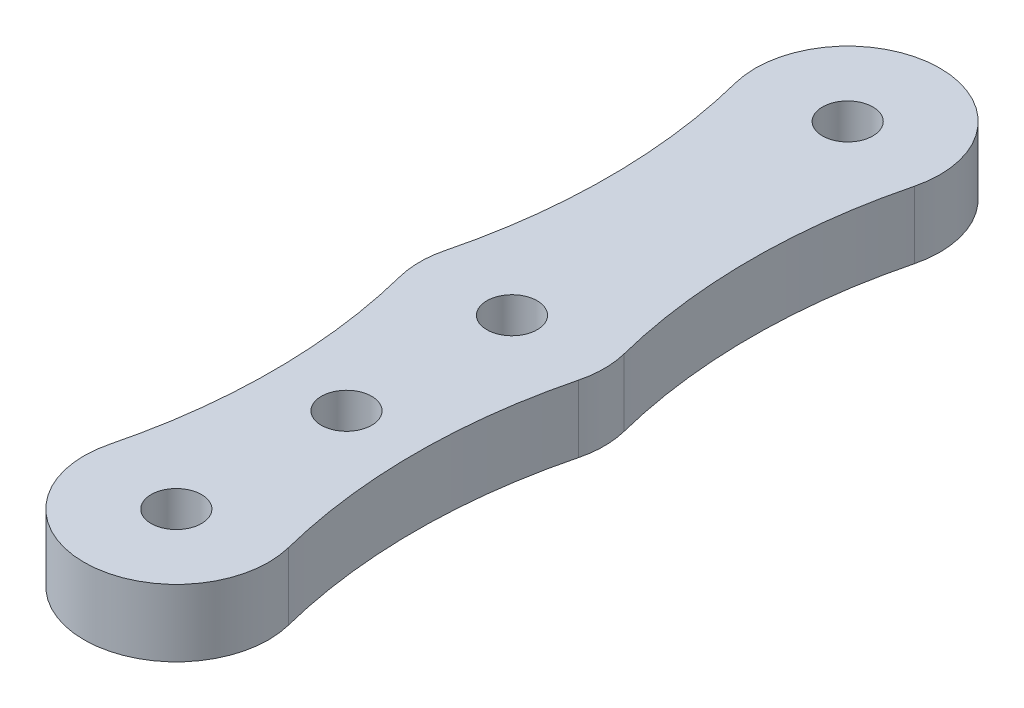
ISO-10303-21;
HEADER;
FILE_DESCRIPTION(('STEP AP214'),'2;1');
FILE_NAME('part.step','',(''),(''),'','','');
FILE_SCHEMA(('AUTOMOTIVE_DESIGN { 1 0 10303 214 1 1 1 1 }'));
ENDSEC;
DATA;
#1=APPLICATION_CONTEXT('core data for automotive mechanical design processes');
#2=APPLICATION_PROTOCOL_DEFINITION('international standard','automotive_design',2000,#1);
#3=PRODUCT_CONTEXT('',#1,'mechanical');
#4=PRODUCT('Part','Part','',(#3));
#5=PRODUCT_RELATED_PRODUCT_CATEGORY('part','',(#4));
#6=PRODUCT_DEFINITION_FORMATION('','',#4);
#7=PRODUCT_DEFINITION_CONTEXT('part definition',#1,'design');
#8=PRODUCT_DEFINITION('design','',#6,#7);
#9=PRODUCT_DEFINITION_SHAPE('','',#8);
#10=(LENGTH_UNIT() NAMED_UNIT(*) SI_UNIT(.MILLI.,.METRE.));
#11=(NAMED_UNIT(*) PLANE_ANGLE_UNIT() SI_UNIT($,.RADIAN.));
#12=(NAMED_UNIT(*) SI_UNIT($,.STERADIAN.) SOLID_ANGLE_UNIT());
#13=UNCERTAINTY_MEASURE_WITH_UNIT(LENGTH_MEASURE(1.E-05),#10,'distance_accuracy_value','');
#14=(GEOMETRIC_REPRESENTATION_CONTEXT(3) GLOBAL_UNCERTAINTY_ASSIGNED_CONTEXT((#13)) GLOBAL_UNIT_ASSIGNED_CONTEXT((#10,
#11,#12)) REPRESENTATION_CONTEXT('',''));
#15=CARTESIAN_POINT('',(0.,0.,0.));
#16=DIRECTION('',(0.,0.,1.));
#17=DIRECTION('',(1.,0.,0.));
#18=AXIS2_PLACEMENT_3D('',#15,#16,#17);
#19=CARTESIAN_POINT('',(-19.6875000000001,4.,-35.));
#20=DIRECTION('',(0.,1.,0.));
#21=DIRECTION('',(0.,0.,1.));
#22=AXIS2_PLACEMENT_3D('',#19,#20,#21);
#23=PLANE('',#22);
#24=CARTESIAN_POINT('',(0.,4.,-40.));
#25=DIRECTION('',(0.,1.,0.));
#26=DIRECTION('',(0.,0.,1.));
#27=AXIS2_PLACEMENT_3D('',#24,#25,#26);
#28=CIRCLE('',#27,1.5);
#29=CARTESIAN_POINT('',(0.,4.,-38.5));
#30=VERTEX_POINT('',#29);
#31=EDGE_CURVE('E188',#30,#30,#28,.T.);
#32=ORIENTED_EDGE('',*,*,#31,.F.);
#33=EDGE_LOOP('',(#32));
#34=FACE_BOUND('',#33,.T.);
#35=CARTESIAN_POINT('',(0.,4.,-10.14));
#36=DIRECTION('',(0.,1.,0.));
#37=DIRECTION('',(0.,0.,1.));
#38=AXIS2_PLACEMENT_3D('',#35,#36,#37);
#39=CIRCLE('',#38,1.5);
#40=CARTESIAN_POINT('',(0.,4.,-8.64));
#41=VERTEX_POINT('',#40);
#42=EDGE_CURVE('E134',#41,#41,#39,.T.);
#43=ORIENTED_EDGE('',*,*,#42,.F.);
#44=EDGE_LOOP('',(#43));
#45=FACE_BOUND('',#44,.T.);
#46=CARTESIAN_POINT('',(-39.3750000000003,4.,-30.));
#47=DIRECTION('',(0.,-1.,0.));
#48=DIRECTION('',(0.,0.,1.));
#49=AXIS2_PLACEMENT_3D('',#46,#47,#48);
#50=CIRCLE('',#49,35.1250000000003);
#51=CARTESIAN_POINT('',(-5.33076923076922,4.,-38.6461538461538));
#52=VERTEX_POINT('',#51);
#53=CARTESIAN_POINT('',(-5.33076923076922,4.,-21.3538461538461));
#54=VERTEX_POINT('',#53);
#55=EDGE_CURVE('E145',#52,#54,#50,.T.);
#56=ORIENTED_EDGE('',*,*,#55,.T.);
#57=CARTESIAN_POINT('',(0.,4.,-20.));
#58=DIRECTION('',(0.,1.,0.));
#59=DIRECTION('',(0.,0.,1.));
#60=AXIS2_PLACEMENT_3D('',#57,#58,#59);
#61=CIRCLE('',#60,5.49999999999999);
#62=CARTESIAN_POINT('',(-5.33076923076922,4.,-18.6461538461538));
#63=VERTEX_POINT('',#62);
#64=EDGE_CURVE('E93',#54,#63,#61,.T.);
#65=ORIENTED_EDGE('',*,*,#64,.T.);
#66=CARTESIAN_POINT('',(-39.3749999999999,4.,-10.));
#67=DIRECTION('',(0.,-1.,0.));
#68=DIRECTION('',(0.,0.,1.));
#69=AXIS2_PLACEMENT_3D('',#66,#67,#68);
#70=CIRCLE('',#69,35.125);
#71=CARTESIAN_POINT('',(-5.33076923076923,4.,-1.35384615384616));
#72=VERTEX_POINT('',#71);
#73=EDGE_CURVE('E160',#63,#72,#70,.T.);
#74=ORIENTED_EDGE('',*,*,#73,.T.);
#75=CARTESIAN_POINT('',(0.,4.,0.));
#76=DIRECTION('',(0.,1.,0.));
#77=DIRECTION('',(0.,0.,1.));
#78=AXIS2_PLACEMENT_3D('',#75,#76,#77);
#79=CIRCLE('',#78,5.5);
#80=CARTESIAN_POINT('',(5.33076923076922,4.,-1.35384615384616));
#81=VERTEX_POINT('',#80);
#82=EDGE_CURVE('E173',#72,#81,#79,.T.);
#83=ORIENTED_EDGE('',*,*,#82,.T.);
#84=CARTESIAN_POINT('',(39.375,4.,-9.99999999999997));
#85=DIRECTION('',(0.,-1.,0.));
#86=DIRECTION('',(0.,0.,1.));
#87=AXIS2_PLACEMENT_3D('',#84,#85,#86);
#88=CIRCLE('',#87,35.125);
#89=CARTESIAN_POINT('',(5.33076923076922,4.,-18.6461538461538));
#90=VERTEX_POINT('',#89);
#91=EDGE_CURVE('E112',#81,#90,#88,.T.);
#92=ORIENTED_EDGE('',*,*,#91,.T.);
#93=CARTESIAN_POINT('',(0.,4.,-20.));
#94=DIRECTION('',(0.,1.,0.));
#95=DIRECTION('',(0.,0.,1.));
#96=AXIS2_PLACEMENT_3D('',#93,#94,#95);
#97=CIRCLE('',#96,5.49999999999999);
#98=CARTESIAN_POINT('',(5.33076923076922,4.,-21.3538461538461));
#99=VERTEX_POINT('',#98);
#100=EDGE_CURVE('E106',#90,#99,#97,.T.);
#101=ORIENTED_EDGE('',*,*,#100,.T.);
#102=CARTESIAN_POINT('',(39.3750000000003,4.,-30.));
#103=DIRECTION('',(0.,-1.,0.));
#104=DIRECTION('',(0.,0.,1.));
#105=AXIS2_PLACEMENT_3D('',#102,#103,#104);
#106=CIRCLE('',#105,35.1250000000003);
#107=CARTESIAN_POINT('',(5.33076923076922,4.,-38.6461538461538));
#108=VERTEX_POINT('',#107);
#109=EDGE_CURVE('E110',#99,#108,#106,.T.);
#110=ORIENTED_EDGE('',*,*,#109,.T.);
#111=CARTESIAN_POINT('',(0.,4.,-40.));
#112=DIRECTION('',(0.,1.,0.));
#113=DIRECTION('',(0.,0.,1.));
#114=AXIS2_PLACEMENT_3D('',#111,#112,#113);
#115=CIRCLE('',#114,5.49999999999999);
#116=EDGE_CURVE('E50',#108,#52,#115,.T.);
#117=ORIENTED_EDGE('',*,*,#116,.T.);
#118=EDGE_LOOP('',(#56,#65,#74,#83,#92,#101,#110,#117));
#119=FACE_BOUND('',#118,.T.);
#120=CARTESIAN_POINT('',(0.,4.,0.));
#121=DIRECTION('',(0.,1.,0.));
#122=DIRECTION('',(0.,0.,1.));
#123=AXIS2_PLACEMENT_3D('',#120,#121,#122);
#124=CIRCLE('',#123,1.5);
#125=CARTESIAN_POINT('',(0.,4.,1.5));
#126=VERTEX_POINT('',#125);
#127=EDGE_CURVE('E182',#126,#126,#124,.T.);
#128=ORIENTED_EDGE('',*,*,#127,.F.);
#129=EDGE_LOOP('',(#128));
#130=FACE_BOUND('',#129,.T.);
#131=CARTESIAN_POINT('',(0.,4.,-20.));
#132=DIRECTION('',(0.,1.,0.));
#133=DIRECTION('',(0.,0.,1.));
#134=AXIS2_PLACEMENT_3D('',#131,#132,#133);
#135=CIRCLE('',#134,1.5);
#136=CARTESIAN_POINT('',(0.,4.,-18.5));
#137=VERTEX_POINT('',#136);
#138=EDGE_CURVE('E194',#137,#137,#135,.T.);
#139=ORIENTED_EDGE('',*,*,#138,.F.);
#140=EDGE_LOOP('',(#139));
#141=FACE_BOUND('',#140,.T.);
#142=ADVANCED_FACE('F33',(#34,#45,#119,#130,#141),#23,.T.);
#143=CARTESIAN_POINT('',(-19.6875000000001,0.,-35.));
#144=DIRECTION('',(0.,1.,0.));
#145=DIRECTION('',(0.,0.,1.));
#146=AXIS2_PLACEMENT_3D('',#143,#144,#145);
#147=PLANE('',#146);
#148=CARTESIAN_POINT('',(-39.3750000000003,0.,-30.));
#149=DIRECTION('',(0.,-1.,0.));
#150=DIRECTION('',(0.,0.,1.));
#151=AXIS2_PLACEMENT_3D('',#148,#149,#150);
#152=CIRCLE('',#151,35.1250000000003);
#153=CARTESIAN_POINT('',(-5.33076923076922,0.,-38.6461538461538));
#154=VERTEX_POINT('',#153);
#155=CARTESIAN_POINT('',(-5.33076923076922,0.,-21.3538461538461));
#156=VERTEX_POINT('',#155);
#157=EDGE_CURVE('E130',#154,#156,#152,.T.);
#158=ORIENTED_EDGE('',*,*,#157,.F.);
#159=CARTESIAN_POINT('',(0.,0.,-40.));
#160=DIRECTION('',(0.,1.,0.));
#161=DIRECTION('',(0.,0.,1.));
#162=AXIS2_PLACEMENT_3D('',#159,#160,#161);
#163=CIRCLE('',#162,5.49999999999999);
#164=CARTESIAN_POINT('',(5.33076923076922,0.,-38.6461538461538));
#165=VERTEX_POINT('',#164);
#166=EDGE_CURVE('E85',#165,#154,#163,.T.);
#167=ORIENTED_EDGE('',*,*,#166,.F.);
#168=CARTESIAN_POINT('',(39.3750000000003,0.,-30.));
#169=DIRECTION('',(0.,-1.,0.));
#170=DIRECTION('',(0.,0.,1.));
#171=AXIS2_PLACEMENT_3D('',#168,#169,#170);
#172=CIRCLE('',#171,35.1250000000003);
#173=CARTESIAN_POINT('',(5.33076923076922,0.,-21.3538461538461));
#174=VERTEX_POINT('',#173);
#175=EDGE_CURVE('E79',#174,#165,#172,.T.);
#176=ORIENTED_EDGE('',*,*,#175,.F.);
#177=CARTESIAN_POINT('',(0.,0.,-20.));
#178=DIRECTION('',(0.,1.,0.));
#179=DIRECTION('',(0.,0.,1.));
#180=AXIS2_PLACEMENT_3D('',#177,#178,#179);
#181=CIRCLE('',#180,5.49999999999999);
#182=CARTESIAN_POINT('',(5.33076923076922,0.,-18.6461538461538));
#183=VERTEX_POINT('',#182);
#184=EDGE_CURVE('E120',#183,#174,#181,.T.);
#185=ORIENTED_EDGE('',*,*,#184,.F.);
#186=CARTESIAN_POINT('',(39.375,0.,-9.99999999999997));
#187=DIRECTION('',(0.,-1.,0.));
#188=DIRECTION('',(0.,0.,1.));
#189=AXIS2_PLACEMENT_3D('',#186,#187,#188);
#190=CIRCLE('',#189,35.125);
#191=CARTESIAN_POINT('',(5.33076923076922,0.,-1.35384615384616));
#192=VERTEX_POINT('',#191);
#193=EDGE_CURVE('E140',#192,#183,#190,.T.);
#194=ORIENTED_EDGE('',*,*,#193,.F.);
#195=CARTESIAN_POINT('',(0.,0.,0.));
#196=DIRECTION('',(0.,1.,0.));
#197=DIRECTION('',(0.,0.,1.));
#198=AXIS2_PLACEMENT_3D('',#195,#196,#197);
#199=CIRCLE('',#198,5.5);
#200=CARTESIAN_POINT('',(-5.33076923076923,0.,-1.35384615384616));
#201=VERTEX_POINT('',#200);
#202=EDGE_CURVE('E138',#201,#192,#199,.T.);
#203=ORIENTED_EDGE('',*,*,#202,.F.);
#204=CARTESIAN_POINT('',(-39.3749999999999,0.,-10.));
#205=DIRECTION('',(0.,-1.,0.));
#206=DIRECTION('',(0.,0.,1.));
#207=AXIS2_PLACEMENT_3D('',#204,#205,#206);
#208=CIRCLE('',#207,35.125);
#209=CARTESIAN_POINT('',(-5.33076923076922,0.,-18.6461538461538));
#210=VERTEX_POINT('',#209);
#211=EDGE_CURVE('E136',#210,#201,#208,.T.);
#212=ORIENTED_EDGE('',*,*,#211,.F.);
#213=CARTESIAN_POINT('',(0.,0.,-20.));
#214=DIRECTION('',(0.,1.,0.));
#215=DIRECTION('',(0.,0.,1.));
#216=AXIS2_PLACEMENT_3D('',#213,#214,#215);
#217=CIRCLE('',#216,5.49999999999999);
#218=EDGE_CURVE('E133',#156,#210,#217,.T.);
#219=ORIENTED_EDGE('',*,*,#218,.F.);
#220=EDGE_LOOP('',(#158,#167,#176,#185,#194,#203,#212,#219));
#221=FACE_BOUND('',#220,.T.);
#222=CARTESIAN_POINT('',(0.,0.,-10.14));
#223=DIRECTION('',(0.,1.,0.));
#224=DIRECTION('',(0.,0.,1.));
#225=AXIS2_PLACEMENT_3D('',#222,#223,#224);
#226=CIRCLE('',#225,1.5);
#227=CARTESIAN_POINT('',(0.,0.,-8.64));
#228=VERTEX_POINT('',#227);
#229=EDGE_CURVE('E179',#228,#228,#226,.T.);
#230=ORIENTED_EDGE('',*,*,#229,.T.);
#231=EDGE_LOOP('',(#230));
#232=FACE_BOUND('',#231,.T.);
#233=CARTESIAN_POINT('',(0.,0.,0.));
#234=DIRECTION('',(0.,1.,0.));
#235=DIRECTION('',(0.,0.,1.));
#236=AXIS2_PLACEMENT_3D('',#233,#234,#235);
#237=CIRCLE('',#236,1.5);
#238=CARTESIAN_POINT('',(0.,0.,1.5));
#239=VERTEX_POINT('',#238);
#240=EDGE_CURVE('E185',#239,#239,#237,.T.);
#241=ORIENTED_EDGE('',*,*,#240,.T.);
#242=EDGE_LOOP('',(#241));
#243=FACE_BOUND('',#242,.T.);
#244=CARTESIAN_POINT('',(0.,0.,-40.));
#245=DIRECTION('',(0.,1.,0.));
#246=DIRECTION('',(0.,0.,1.));
#247=AXIS2_PLACEMENT_3D('',#244,#245,#246);
#248=CIRCLE('',#247,1.5);
#249=CARTESIAN_POINT('',(0.,0.,-38.5));
#250=VERTEX_POINT('',#249);
#251=EDGE_CURVE('E191',#250,#250,#248,.T.);
#252=ORIENTED_EDGE('',*,*,#251,.T.);
#253=EDGE_LOOP('',(#252));
#254=FACE_BOUND('',#253,.T.);
#255=CARTESIAN_POINT('',(0.,0.,-20.));
#256=DIRECTION('',(0.,1.,0.));
#257=DIRECTION('',(0.,0.,1.));
#258=AXIS2_PLACEMENT_3D('',#255,#256,#257);
#259=CIRCLE('',#258,1.5);
#260=CARTESIAN_POINT('',(0.,0.,-18.5));
#261=VERTEX_POINT('',#260);
#262=EDGE_CURVE('E197',#261,#261,#259,.T.);
#263=ORIENTED_EDGE('',*,*,#262,.T.);
#264=EDGE_LOOP('',(#263));
#265=FACE_BOUND('',#264,.T.);
#266=ADVANCED_FACE('F164',(#221,#232,#243,#254,#265),#147,.F.);
#267=CARTESIAN_POINT('',(-39.3750000000003,4.,-30.));
#268=DIRECTION('',(0.,-1.,0.));
#269=DIRECTION('',(0.,0.,-1.));
#270=AXIS2_PLACEMENT_3D('',#267,#268,#269);
#271=CYLINDRICAL_SURFACE('',#270,35.1250000000003);
#272=ORIENTED_EDGE('',*,*,#157,.T.);
#273=DIRECTION('',(0.,-1.,0.));
#274=VECTOR('',#273,1.);
#275=CARTESIAN_POINT('',(-5.33076923076922,4.,-21.3538461538461));
#276=LINE('',#275,#274);
#277=EDGE_CURVE('E11',#54,#156,#276,.T.);
#278=ORIENTED_EDGE('',*,*,#277,.F.);
#279=ORIENTED_EDGE('',*,*,#55,.F.);
#280=DIRECTION('',(0.,-1.,0.));
#281=VECTOR('',#280,1.);
#282=CARTESIAN_POINT('',(-5.33076923076922,4.,-38.6461538461538));
#283=LINE('',#282,#281);
#284=EDGE_CURVE('E126',#52,#154,#283,.T.);
#285=ORIENTED_EDGE('',*,*,#284,.T.);
#286=EDGE_LOOP('',(#272,#278,#279,#285));
#287=FACE_BOUND('',#286,.T.);
#288=ADVANCED_FACE('F35',(#287),#271,.F.);
#289=CARTESIAN_POINT('',(0.,4.,-20.));
#290=DIRECTION('',(0.,-1.,0.));
#291=DIRECTION('',(0.,0.,-1.));
#292=AXIS2_PLACEMENT_3D('',#289,#290,#291);
#293=CYLINDRICAL_SURFACE('',#292,5.49999999999999);
#294=ORIENTED_EDGE('',*,*,#218,.T.);
#295=DIRECTION('',(0.,-1.,0.));
#296=VECTOR('',#295,1.);
#297=CARTESIAN_POINT('',(-5.33076923076922,4.,-18.6461538461538));
#298=LINE('',#297,#296);
#299=EDGE_CURVE('E42',#63,#210,#298,.T.);
#300=ORIENTED_EDGE('',*,*,#299,.F.);
#301=ORIENTED_EDGE('',*,*,#64,.F.);
#302=ORIENTED_EDGE('',*,*,#277,.T.);
#303=EDGE_LOOP('',(#294,#300,#301,#302));
#304=FACE_BOUND('',#303,.T.);
#305=ADVANCED_FACE('F231',(#304),#293,.T.);
#306=CARTESIAN_POINT('',(-39.3749999999999,4.,-10.));
#307=DIRECTION('',(0.,-1.,0.));
#308=DIRECTION('',(0.,0.,-1.));
#309=AXIS2_PLACEMENT_3D('',#306,#307,#308);
#310=CYLINDRICAL_SURFACE('',#309,35.125);
#311=ORIENTED_EDGE('',*,*,#211,.T.);
#312=DIRECTION('',(0.,-1.,0.));
#313=VECTOR('',#312,1.);
#314=CARTESIAN_POINT('',(-5.33076923076923,4.,-1.35384615384616));
#315=LINE('',#314,#313);
#316=EDGE_CURVE('E152',#72,#201,#315,.T.);
#317=ORIENTED_EDGE('',*,*,#316,.F.);
#318=ORIENTED_EDGE('',*,*,#73,.F.);
#319=ORIENTED_EDGE('',*,*,#299,.T.);
#320=EDGE_LOOP('',(#311,#317,#318,#319));
#321=FACE_BOUND('',#320,.T.);
#322=ADVANCED_FACE('F158',(#321),#310,.F.);
#323=CARTESIAN_POINT('',(0.,4.,0.));
#324=DIRECTION('',(0.,-1.,0.));
#325=DIRECTION('',(0.,0.,-1.));
#326=AXIS2_PLACEMENT_3D('',#323,#324,#325);
#327=CYLINDRICAL_SURFACE('',#326,5.5);
#328=ORIENTED_EDGE('',*,*,#202,.T.);
#329=DIRECTION('',(0.,-1.,0.));
#330=VECTOR('',#329,1.);
#331=CARTESIAN_POINT('',(5.33076923076922,4.,-1.35384615384616));
#332=LINE('',#331,#330);
#333=EDGE_CURVE('E149',#81,#192,#332,.T.);
#334=ORIENTED_EDGE('',*,*,#333,.F.);
#335=ORIENTED_EDGE('',*,*,#82,.F.);
#336=ORIENTED_EDGE('',*,*,#316,.T.);
#337=EDGE_LOOP('',(#328,#334,#335,#336));
#338=FACE_BOUND('',#337,.T.);
#339=ADVANCED_FACE('F169',(#338),#327,.T.);
#340=CARTESIAN_POINT('',(39.375,4.,-9.99999999999997));
#341=DIRECTION('',(0.,-1.,0.));
#342=DIRECTION('',(0.,0.,-1.));
#343=AXIS2_PLACEMENT_3D('',#340,#341,#342);
#344=CYLINDRICAL_SURFACE('',#343,35.125);
#345=ORIENTED_EDGE('',*,*,#193,.T.);
#346=DIRECTION('',(0.,-1.,0.));
#347=VECTOR('',#346,1.);
#348=CARTESIAN_POINT('',(5.33076923076922,4.,-18.6461538461538));
#349=LINE('',#348,#347);
#350=EDGE_CURVE('E121',#90,#183,#349,.T.);
#351=ORIENTED_EDGE('',*,*,#350,.F.);
#352=ORIENTED_EDGE('',*,*,#91,.F.);
#353=ORIENTED_EDGE('',*,*,#333,.T.);
#354=EDGE_LOOP('',(#345,#351,#352,#353));
#355=FACE_BOUND('',#354,.T.);
#356=ADVANCED_FACE('F172',(#355),#344,.F.);
#357=CARTESIAN_POINT('',(0.,4.,-20.));
#358=DIRECTION('',(0.,-1.,0.));
#359=DIRECTION('',(0.,0.,-1.));
#360=AXIS2_PLACEMENT_3D('',#357,#358,#359);
#361=CYLINDRICAL_SURFACE('',#360,5.49999999999999);
#362=ORIENTED_EDGE('',*,*,#184,.T.);
#363=DIRECTION('',(0.,-1.,0.));
#364=VECTOR('',#363,1.);
#365=CARTESIAN_POINT('',(5.33076923076922,4.,-21.3538461538461));
#366=LINE('',#365,#364);
#367=EDGE_CURVE('E117',#99,#174,#366,.T.);
#368=ORIENTED_EDGE('',*,*,#367,.F.);
#369=ORIENTED_EDGE('',*,*,#100,.F.);
#370=ORIENTED_EDGE('',*,*,#350,.T.);
#371=EDGE_LOOP('',(#362,#368,#369,#370));
#372=FACE_BOUND('',#371,.T.);
#373=ADVANCED_FACE('F118',(#372),#361,.T.);
#374=CARTESIAN_POINT('',(39.3750000000003,4.,-30.));
#375=DIRECTION('',(0.,-1.,0.));
#376=DIRECTION('',(0.,0.,-1.));
#377=AXIS2_PLACEMENT_3D('',#374,#375,#376);
#378=CYLINDRICAL_SURFACE('',#377,35.1250000000003);
#379=ORIENTED_EDGE('',*,*,#175,.T.);
#380=DIRECTION('',(0.,-1.,0.));
#381=VECTOR('',#380,1.);
#382=CARTESIAN_POINT('',(5.33076923076922,4.,-38.6461538461538));
#383=LINE('',#382,#381);
#384=EDGE_CURVE('E122',#108,#165,#383,.T.);
#385=ORIENTED_EDGE('',*,*,#384,.F.);
#386=ORIENTED_EDGE('',*,*,#109,.F.);
#387=ORIENTED_EDGE('',*,*,#367,.T.);
#388=EDGE_LOOP('',(#379,#385,#386,#387));
#389=FACE_BOUND('',#388,.T.);
#390=ADVANCED_FACE('F124',(#389),#378,.F.);
#391=CARTESIAN_POINT('',(0.,4.,-40.));
#392=DIRECTION('',(0.,-1.,0.));
#393=DIRECTION('',(0.,0.,-1.));
#394=AXIS2_PLACEMENT_3D('',#391,#392,#393);
#395=CYLINDRICAL_SURFACE('',#394,5.49999999999999);
#396=ORIENTED_EDGE('',*,*,#166,.T.);
#397=ORIENTED_EDGE('',*,*,#284,.F.);
#398=ORIENTED_EDGE('',*,*,#116,.F.);
#399=ORIENTED_EDGE('',*,*,#384,.T.);
#400=EDGE_LOOP('',(#396,#397,#398,#399));
#401=FACE_BOUND('',#400,.T.);
#402=ADVANCED_FACE('F219',(#401),#395,.T.);
#403=CARTESIAN_POINT('',(0.,4.,-10.14));
#404=DIRECTION('',(0.,-1.,0.));
#405=DIRECTION('',(0.,0.,-1.));
#406=AXIS2_PLACEMENT_3D('',#403,#404,#405);
#407=CYLINDRICAL_SURFACE('',#406,1.5);
#408=ORIENTED_EDGE('',*,*,#42,.T.);
#409=EDGE_LOOP('',(#408));
#410=FACE_BOUND('',#409,.T.);
#411=ORIENTED_EDGE('',*,*,#229,.F.);
#412=EDGE_LOOP('',(#411));
#413=FACE_BOUND('',#412,.T.);
#414=ADVANCED_FACE('F216',(#410,#413),#407,.F.);
#415=CARTESIAN_POINT('',(0.,4.,0.));
#416=DIRECTION('',(0.,-1.,0.));
#417=DIRECTION('',(0.,0.,-1.));
#418=AXIS2_PLACEMENT_3D('',#415,#416,#417);
#419=CYLINDRICAL_SURFACE('',#418,1.5);
#420=ORIENTED_EDGE('',*,*,#127,.T.);
#421=EDGE_LOOP('',(#420));
#422=FACE_BOUND('',#421,.T.);
#423=ORIENTED_EDGE('',*,*,#240,.F.);
#424=EDGE_LOOP('',(#423));
#425=FACE_BOUND('',#424,.T.);
#426=ADVANCED_FACE('F295',(#422,#425),#419,.F.);
#427=CARTESIAN_POINT('',(0.,4.,-40.));
#428=DIRECTION('',(0.,-1.,0.));
#429=DIRECTION('',(0.,0.,-1.));
#430=AXIS2_PLACEMENT_3D('',#427,#428,#429);
#431=CYLINDRICAL_SURFACE('',#430,1.5);
#432=ORIENTED_EDGE('',*,*,#31,.T.);
#433=EDGE_LOOP('',(#432));
#434=FACE_BOUND('',#433,.T.);
#435=ORIENTED_EDGE('',*,*,#251,.F.);
#436=EDGE_LOOP('',(#435));
#437=FACE_BOUND('',#436,.T.);
#438=ADVANCED_FACE('F303',(#434,#437),#431,.F.);
#439=CARTESIAN_POINT('',(0.,4.,-20.));
#440=DIRECTION('',(0.,-1.,0.));
#441=DIRECTION('',(0.,0.,-1.));
#442=AXIS2_PLACEMENT_3D('',#439,#440,#441);
#443=CYLINDRICAL_SURFACE('',#442,1.5);
#444=ORIENTED_EDGE('',*,*,#138,.T.);
#445=EDGE_LOOP('',(#444));
#446=FACE_BOUND('',#445,.T.);
#447=ORIENTED_EDGE('',*,*,#262,.F.);
#448=EDGE_LOOP('',(#447));
#449=FACE_BOUND('',#448,.T.);
#450=ADVANCED_FACE('F203',(#446,#449),#443,.F.);
#451=CLOSED_SHELL('',(#142,#266,#288,#305,#322,#339,#356,#373,#390,#402,#414,#426,#438,#450));
#452=MANIFOLD_SOLID_BREP('B2',#451);
#453=ADVANCED_BREP_SHAPE_REPRESENTATION('',(#18,#452),#14);
#454=SHAPE_DEFINITION_REPRESENTATION(#9,#453);
ENDSEC;
END-ISO-10303-21;
